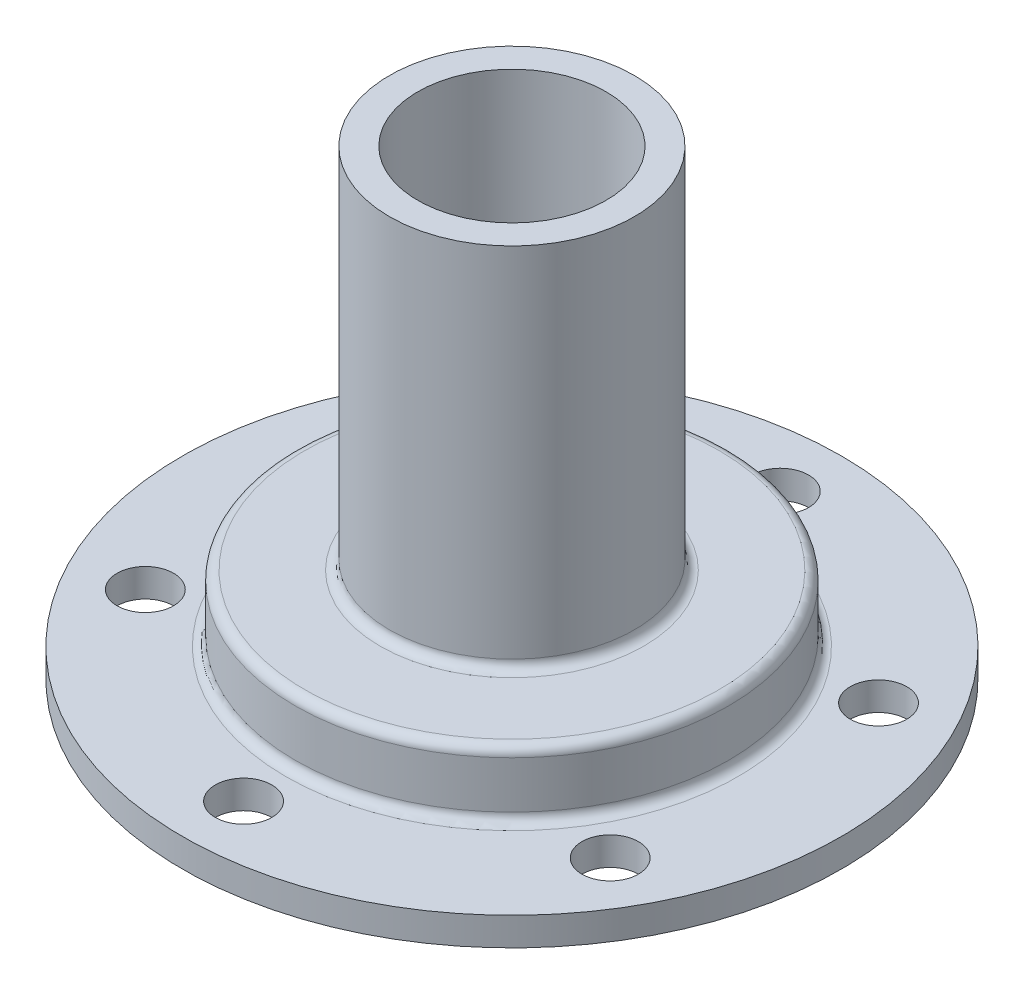
ISO-10303-21;
HEADER;
FILE_DESCRIPTION(('STEP AP214'),'2;1');
FILE_NAME('part.step','',(''),(''),'','','');
FILE_SCHEMA(('AUTOMOTIVE_DESIGN { 1 0 10303 214 1 1 1 1 }'));
ENDSEC;
DATA;
#1=APPLICATION_CONTEXT('core data for automotive mechanical design processes');
#2=APPLICATION_PROTOCOL_DEFINITION('international standard','automotive_design',2000,#1);
#3=PRODUCT_CONTEXT('',#1,'mechanical');
#4=PRODUCT('Part','Part','',(#3));
#5=PRODUCT_RELATED_PRODUCT_CATEGORY('part','',(#4));
#6=PRODUCT_DEFINITION_FORMATION('','',#4);
#7=PRODUCT_DEFINITION_CONTEXT('part definition',#1,'design');
#8=PRODUCT_DEFINITION('design','',#6,#7);
#9=PRODUCT_DEFINITION_SHAPE('','',#8);
#10=(LENGTH_UNIT() NAMED_UNIT(*) SI_UNIT(.MILLI.,.METRE.));
#11=(NAMED_UNIT(*) PLANE_ANGLE_UNIT() SI_UNIT($,.RADIAN.));
#12=(NAMED_UNIT(*) SI_UNIT($,.STERADIAN.) SOLID_ANGLE_UNIT());
#13=UNCERTAINTY_MEASURE_WITH_UNIT(LENGTH_MEASURE(1.E-05),#10,'distance_accuracy_value','');
#14=(GEOMETRIC_REPRESENTATION_CONTEXT(3) GLOBAL_UNCERTAINTY_ASSIGNED_CONTEXT((#13)) GLOBAL_UNIT_ASSIGNED_CONTEXT((#10,
#11,#12)) REPRESENTATION_CONTEXT('',''));
#15=CARTESIAN_POINT('',(0.,0.,0.));
#16=DIRECTION('',(0.,0.,1.));
#17=DIRECTION('',(1.,0.,0.));
#18=AXIS2_PLACEMENT_3D('',#15,#16,#17);
#19=CARTESIAN_POINT('',(0.,0.,0.));
#20=DIRECTION('',(0.,-1.,0.));
#21=DIRECTION('',(0.,0.,-1.));
#22=AXIS2_PLACEMENT_3D('',#19,#20,#21);
#23=CYLINDRICAL_SURFACE('',#22,20.);
#24=CARTESIAN_POINT('',(0.,0.,0.));
#25=DIRECTION('',(0.,-1.,0.));
#26=DIRECTION('',(0.,0.,-1.));
#27=AXIS2_PLACEMENT_3D('',#24,#25,#26);
#28=CIRCLE('',#27,20.);
#29=CARTESIAN_POINT('',(0.,0.,-20.));
#30=VERTEX_POINT('',#29);
#31=EDGE_CURVE('E84',#30,#30,#28,.T.);
#32=ORIENTED_EDGE('',*,*,#31,.T.);
#33=EDGE_LOOP('',(#32));
#34=FACE_BOUND('',#33,.T.);
#35=CARTESIAN_POINT('',(0.,6.,0.));
#36=DIRECTION('',(0.,-1.,0.));
#37=DIRECTION('',(0.,0.,-1.));
#38=AXIS2_PLACEMENT_3D('',#35,#36,#37);
#39=CIRCLE('',#38,20.);
#40=CARTESIAN_POINT('',(0.,6.,-20.));
#41=VERTEX_POINT('',#40);
#42=EDGE_CURVE('E10',#41,#41,#39,.T.);
#43=ORIENTED_EDGE('',*,*,#42,.F.);
#44=EDGE_LOOP('',(#43));
#45=FACE_BOUND('',#44,.T.);
#46=ADVANCED_FACE('F34',(#34,#45),#23,.F.);
#47=CARTESIAN_POINT('',(0.,6.,0.));
#48=DIRECTION('',(0.,-1.,0.));
#49=DIRECTION('',(0.,0.,-1.));
#50=AXIS2_PLACEMENT_3D('',#47,#48,#49);
#51=TOROIDAL_SURFACE('',#50,19.,0.999999999999999);
#52=ORIENTED_EDGE('',*,*,#42,.T.);
#53=EDGE_LOOP('',(#52));
#54=FACE_BOUND('',#53,.T.);
#55=CARTESIAN_POINT('',(0.,7.,0.));
#56=DIRECTION('',(0.,-1.,0.));
#57=DIRECTION('',(0.,0.,-1.));
#58=AXIS2_PLACEMENT_3D('',#55,#56,#57);
#59=CIRCLE('',#58,19.);
#60=CARTESIAN_POINT('',(0.,7.,-19.));
#61=VERTEX_POINT('',#60);
#62=EDGE_CURVE('E45',#61,#61,#59,.T.);
#63=ORIENTED_EDGE('',*,*,#62,.F.);
#64=EDGE_LOOP('',(#63));
#65=FACE_BOUND('',#64,.T.);
#66=ADVANCED_FACE('F207',(#54,#65),#51,.F.);
#67=CARTESIAN_POINT('',(10.,7.,0.));
#68=DIRECTION('',(0.,-1.,0.));
#69=DIRECTION('',(0.,0.,-1.));
#70=AXIS2_PLACEMENT_3D('',#67,#68,#69);
#71=PLANE('',#70);
#72=ORIENTED_EDGE('',*,*,#62,.T.);
#73=EDGE_LOOP('',(#72));
#74=FACE_BOUND('',#73,.T.);
#75=CARTESIAN_POINT('',(0.,7.,0.));
#76=DIRECTION('',(0.,-1.,0.));
#77=DIRECTION('',(0.,0.,-1.));
#78=AXIS2_PLACEMENT_3D('',#75,#76,#77);
#79=CIRCLE('',#78,10.);
#80=CARTESIAN_POINT('',(0.,7.,-10.));
#81=VERTEX_POINT('',#80);
#82=EDGE_CURVE('E49',#81,#81,#79,.T.);
#83=ORIENTED_EDGE('',*,*,#82,.F.);
#84=EDGE_LOOP('',(#83));
#85=FACE_BOUND('',#84,.T.);
#86=ADVANCED_FACE('F203',(#74,#85),#71,.T.);
#87=CARTESIAN_POINT('',(0.,0.,0.));
#88=DIRECTION('',(0.,-1.,0.));
#89=DIRECTION('',(0.,0.,-1.));
#90=AXIS2_PLACEMENT_3D('',#87,#88,#89);
#91=CYLINDRICAL_SURFACE('',#90,10.);
#92=CARTESIAN_POINT('',(-9.68245836551854,34.,-2.5));
#93=CARTESIAN_POINT('',(-9.6824610008786,34.1380507509266,-2.49999607859307));
#94=CARTESIAN_POINT('',(-9.68544306014597,34.2761448986785,-2.48852624549765));
#95=CARTESIAN_POINT('',(-9.69701861992564,34.5483675781735,-2.44302312546379));
#96=CARTESIAN_POINT('',(-9.7056153862163,34.6824937544682,-2.40897670674211));
#97=CARTESIAN_POINT('',(-9.72738724596151,34.9428035381872,-2.31949119963204));
#98=CARTESIAN_POINT('',(-9.74055642690458,35.0689971553857,-2.26407972785449));
#99=CARTESIAN_POINT('',(-9.76998192028759,35.3103108525399,-2.13352114126138));
#100=CARTESIAN_POINT('',(-9.78623836378489,35.4254304620802,-2.05837318856068));
#101=CARTESIAN_POINT('',(-9.82040716355625,35.6438616452622,-1.88870842731188));
#102=CARTESIAN_POINT('',(-9.83834597623034,35.74689360035,-1.79383688770405));
#103=CARTESIAN_POINT('',(-9.87362875515294,35.9357613943603,-1.58818206410066));
#104=CARTESIAN_POINT('',(-9.89097266566389,36.0215956256217,-1.4773972941803));
#105=CARTESIAN_POINT('',(-9.92340415520583,36.1747754676313,-1.24114520107895));
#106=CARTESIAN_POINT('',(-9.93845687400593,36.2418463881615,-1.11549457619512));
#107=CARTESIAN_POINT('',(-9.96430811925984,36.3538096441531,-0.854263184292761));
#108=CARTESIAN_POINT('',(-9.97510727334345,36.3987052519155,-0.718683885791939));
#109=CARTESIAN_POINT('',(-9.9910475884818,36.4641478345786,-0.44435875875416));
#110=CARTESIAN_POINT('',(-9.99629893844314,36.4851696443266,-0.305732719548974));
#111=CARTESIAN_POINT('',(-10.000935941073,36.5037583792756,-0.0268288192627668));
#112=CARTESIAN_POINT('',(-10.000322460967,36.5013287722096,0.113448794538072));
#113=CARTESIAN_POINT('',(-9.99338094953534,36.4734251497499,0.388380617930973));
#114=CARTESIAN_POINT('',(-9.98718002340871,36.4484636749461,0.523090539002673));
#115=CARTESIAN_POINT('',(-9.96990836524857,36.3770287299515,0.786345618534221));
#116=CARTESIAN_POINT('',(-9.95883737398452,36.3305541146226,0.914890448426099));
#117=CARTESIAN_POINT('',(-9.93287509700884,36.2169974293129,1.16351675875452));
#118=CARTESIAN_POINT('',(-9.91795019695011,36.1497329553383,1.28351127441627));
#119=CARTESIAN_POINT('',(-9.88589903809692,35.9966443208837,1.51068905585123));
#120=CARTESIAN_POINT('',(-9.8687723965265,35.9108169314394,1.61787008771377));
#121=CARTESIAN_POINT('',(-9.83363713769356,35.7202912580176,1.81943508771239));
#122=CARTESIAN_POINT('',(-9.81561719525297,35.6151451076522,1.913394197688));
#123=CARTESIAN_POINT('',(-9.78115043517327,35.3904000264597,2.08244093990756));
#124=CARTESIAN_POINT('',(-9.76470369108288,35.2708004205089,2.15752769011507));
#125=CARTESIAN_POINT('',(-9.73520496829319,35.0197099658511,2.28697032255647));
#126=CARTESIAN_POINT('',(-9.72216983717007,34.8881642696872,2.34122391742613));
#127=CARTESIAN_POINT('',(-9.70118640148669,34.6174145319231,2.42671405159096));
#128=CARTESIAN_POINT('',(-9.69323700842733,34.4782121360154,2.45795551638266));
#129=CARTESIAN_POINT('',(-9.68355356007457,34.2000404984701,2.49582963866592));
#130=CARTESIAN_POINT('',(-9.68166088976934,34.061162206659,2.50309047391912));
#131=CARTESIAN_POINT('',(-9.68387343364692,33.7841780634147,2.49451699051516));
#132=CARTESIAN_POINT('',(-9.687978095703,33.6460721420505,2.47868479784981));
#133=CARTESIAN_POINT('',(-9.7015708198498,33.3768857350514,2.42492546393825));
#134=CARTESIAN_POINT('',(-9.71096970242532,33.2457272734308,2.38736406828191));
#135=CARTESIAN_POINT('',(-9.73400718262805,32.9915685421467,2.29161808167046));
#136=CARTESIAN_POINT('',(-9.74764628246408,32.8685692409442,2.2334310477125));
#137=CARTESIAN_POINT('',(-9.77796137095512,32.6315587221331,2.0967706679366));
#138=CARTESIAN_POINT('',(-9.79469168607245,32.517771159957,2.01792175383564));
#139=CARTESIAN_POINT('',(-9.82917083071113,32.3048116371985,1.84265073233613));
#140=CARTESIAN_POINT('',(-9.84691982728307,32.2056420833499,1.74622573701359));
#141=CARTESIAN_POINT('',(-9.88197403031774,32.0221889574291,1.53565680246182));
#142=CARTESIAN_POINT('',(-9.8992570206188,31.9383399374512,1.42112988132898));
#143=CARTESIAN_POINT('',(-9.9309721661369,31.7910641330487,1.17925670673668));
#144=CARTESIAN_POINT('',(-9.9454044700395,31.7276362833918,1.05191112239398));
#145=CARTESIAN_POINT('',(-9.96970115738325,31.6235539654721,0.788895504327725));
#146=CARTESIAN_POINT('',(-9.9795983002241,31.5827357156209,0.653293452569702));
#147=CARTESIAN_POINT('',(-9.99385293395789,31.5245396653916,0.376874400797013));
#148=CARTESIAN_POINT('',(-9.99821149393422,31.507157341261,0.236058412603098));
#149=CARTESIAN_POINT('',(-10.0008542352202,31.4965810260612,-0.0427088161083107));
#150=CARTESIAN_POINT('',(-9.99929947199971,31.5027457272615,-0.180634567415057));
#151=CARTESIAN_POINT('',(-9.99064741143608,31.5376195682359,-0.45341874103688));
#152=CARTESIAN_POINT('',(-9.98355027892923,31.5663280375329,-0.588277254452324));
#153=CARTESIAN_POINT('',(-9.96463582134723,31.6451305494271,-0.850427589111938));
#154=CARTESIAN_POINT('',(-9.95284411255981,31.6951086332859,-0.977756236452161));
#155=CARTESIAN_POINT('',(-9.92578222284145,31.8149264475489,-1.22229263260406));
#156=CARTESIAN_POINT('',(-9.91051160346894,31.8847686816762,-1.33949910316409));
#157=CARTESIAN_POINT('',(-9.87768124200718,32.0442880849903,-1.56350482105826));
#158=CARTESIAN_POINT('',(-9.86007542354162,32.1344003572596,-1.66998747074584));
#159=CARTESIAN_POINT('',(-9.82476622642974,32.3310571299434,-1.86653755068376));
#160=CARTESIAN_POINT('',(-9.80706282418256,32.4376057902779,-1.95660081269148));
#161=CARTESIAN_POINT('',(-9.77318689613756,32.6665035354737,-2.11940506617959));
#162=CARTESIAN_POINT('',(-9.75704909183222,32.7891103084131,-2.19179154854095));
#163=CARTESIAN_POINT('',(-9.7285988873707,33.0451387246871,-2.31481724146368));
#164=CARTESIAN_POINT('',(-9.71628370583035,33.1785524152346,-2.36547227438038));
#165=CARTESIAN_POINT('',(-9.69879771876843,33.4264425295879,-2.43605632142751));
#166=CARTESIAN_POINT('',(-9.69271657508747,33.5397329109653,-2.4599829264922));
#167=CARTESIAN_POINT('',(-9.6845459645655,33.7686721724942,-2.49195573142943));
#168=CARTESIAN_POINT('',(-9.6824561572277,33.884320850611,-2.50000328592938));
#169=CARTESIAN_POINT('',(-9.68245836551854,34.,-2.5));
#170=B_SPLINE_CURVE_WITH_KNOTS('',3,(#92,#93,#94,#95,#96,#97,#98,#99,#100,#101,#102,#103,#104,
#105,#106,#107,#108,#109,#110,#111,#112,#113,#114,#115,#116,#117,#118,#119,#120,#121,#122,#123,
#124,#125,#126,#127,#128,#129,#130,#131,#132,#133,#134,#135,#136,#137,#138,#139,#140,#141,#142,
#143,#144,#145,#146,#147,#148,#149,#150,#151,#152,#153,#154,#155,#156,#157,#158,#159,#160,#161,
#162,#163,#164,#165,#166,#167,#168,#169),.UNSPECIFIED.,.T.,.F.,(4,2,2,2,2,2,2,2,2,2,2,2,2,2,2,2,
2,2,2,2,2,2,2,2,2,2,2,2,2,2,2,2,2,2,2,2,2,2,4),(0.,0.413727441736142,0.82769574142867,
1.24113072716602,1.65458326755479,2.07623954192977,2.49793521479867,2.9255149639792,
3.35303159847093,3.77188750995347,4.19068148666021,4.60018262688948,5.00970556724787,
5.42292874254446,5.83622385468915,6.26070466571913,6.68520531199803,7.11176432008404,
7.53823200129548,7.95343574764205,8.36860127188748,8.77697405014153,9.18539521426364,
9.60182845864103,10.0183301888999,10.4452533097027,10.872154157245,11.2959207281188,
11.7196054891398,12.131834461324,12.5440511738193,12.9540487656466,13.3640980574302,
13.7839709658702,14.2039503157046,14.6317647729114,15.0592672137502,15.4059782718573,
15.7526597510792),.UNSPECIFIED.);
#171=CARTESIAN_POINT('',(-9.68245836551854,34.,-2.5));
#172=VERTEX_POINT('',#171);
#173=EDGE_CURVE('E121',#172,#172,#170,.T.);
#174=ORIENTED_EDGE('',*,*,#173,.F.);
#175=EDGE_LOOP('',(#174));
#176=FACE_BOUND('',#175,.T.);
#177=ORIENTED_EDGE('',*,*,#82,.T.);
#178=EDGE_LOOP('',(#177));
#179=FACE_BOUND('',#178,.T.);
#180=CARTESIAN_POINT('',(0.,49.,0.));
#181=DIRECTION('',(0.,-1.,0.));
#182=DIRECTION('',(0.,0.,-1.));
#183=AXIS2_PLACEMENT_3D('',#180,#181,#182);
#184=CIRCLE('',#183,10.);
#185=CARTESIAN_POINT('',(0.,49.,-10.));
#186=VERTEX_POINT('',#185);
#187=EDGE_CURVE('E54',#186,#186,#184,.T.);
#188=ORIENTED_EDGE('',*,*,#187,.F.);
#189=EDGE_LOOP('',(#188));
#190=FACE_BOUND('',#189,.T.);
#191=ADVANCED_FACE('F128',(#176,#179,#190),#91,.F.);
#192=CARTESIAN_POINT('',(13.,49.,0.));
#193=DIRECTION('',(0.,1.,0.));
#194=DIRECTION('',(0.,0.,1.));
#195=AXIS2_PLACEMENT_3D('',#192,#193,#194);
#196=PLANE('',#195);
#197=ORIENTED_EDGE('',*,*,#187,.T.);
#198=EDGE_LOOP('',(#197));
#199=FACE_BOUND('',#198,.T.);
#200=CARTESIAN_POINT('',(0.,49.,0.));
#201=DIRECTION('',(0.,-1.,0.));
#202=DIRECTION('',(0.,0.,-1.));
#203=AXIS2_PLACEMENT_3D('',#200,#201,#202);
#204=CIRCLE('',#203,13.);
#205=CARTESIAN_POINT('',(0.,49.,-13.));
#206=VERTEX_POINT('',#205);
#207=EDGE_CURVE('E57',#206,#206,#204,.T.);
#208=ORIENTED_EDGE('',*,*,#207,.F.);
#209=EDGE_LOOP('',(#208));
#210=FACE_BOUND('',#209,.T.);
#211=ADVANCED_FACE('F196',(#199,#210),#196,.T.);
#212=CARTESIAN_POINT('',(0.,0.,0.));
#213=DIRECTION('',(0.,-1.,0.));
#214=DIRECTION('',(0.,0.,-1.));
#215=AXIS2_PLACEMENT_3D('',#212,#213,#214);
#216=CYLINDRICAL_SURFACE('',#215,13.);
#217=CARTESIAN_POINT('',(-12.7573508221731,34.,-2.5));
#218=CARTESIAN_POINT('',(-12.7573535445971,33.8609741402386,-2.49999473771111));
#219=CARTESIAN_POINT('',(-12.759648106677,33.7218807698169,-2.48836372459743));
#220=CARTESIAN_POINT('',(-12.7685662321878,33.4476209411147,-2.44218113719487));
#221=CARTESIAN_POINT('',(-12.7751933891363,33.3124578399415,-2.40761053611891));
#222=CARTESIAN_POINT('',(-12.7919990068767,33.0500663552577,-2.31665374663639));
#223=CARTESIAN_POINT('',(-12.8021740742201,32.9228305261755,-2.26028839852833));
#224=CARTESIAN_POINT('',(-12.8249250156472,32.6796274500609,-2.12739803553043));
#225=CARTESIAN_POINT('',(-12.8375007225812,32.5636594193318,-2.05087442406184));
#226=CARTESIAN_POINT('',(-12.8638197867113,32.3447587875637,-1.8787724582243));
#227=CARTESIAN_POINT('',(-12.8775751102276,32.2419950504917,-1.78298111863696));
#228=CARTESIAN_POINT('',(-12.9045979802699,32.0538924698524,-1.5755231225806));
#229=CARTESIAN_POINT('',(-12.9178654939172,31.9685547990555,-1.46385539849172));
#230=CARTESIAN_POINT('',(-12.9425463769484,31.8170765897423,-1.22670187107625));
#231=CARTESIAN_POINT('',(-12.9539439985905,31.751095741295,-1.10111228887017));
#232=CARTESIAN_POINT('',(-12.9734667695503,31.6412335746728,-0.840374478610752));
#233=CARTESIAN_POINT('',(-12.9815922019259,31.5973503448801,-0.705227078537796));
#234=CARTESIAN_POINT('',(-12.9935705508999,31.5334525964944,-0.43096084517345));
#235=CARTESIAN_POINT('',(-12.9974744160998,31.5131532248799,-0.291910638125103));
#236=CARTESIAN_POINT('',(-13.0007455117712,31.4961114167779,-0.0123270709409613));
#237=CARTESIAN_POINT('',(-13.000113147748,31.499366874664,0.128206155502511));
#238=CARTESIAN_POINT('',(-12.9944227232997,31.5291247626059,0.404811580289862));
#239=CARTESIAN_POINT('',(-12.9894230651197,31.5553204331309,0.540918156089662));
#240=CARTESIAN_POINT('',(-12.9756254537905,31.6297294543125,0.806767049653702));
#241=CARTESIAN_POINT('',(-12.9668273569848,31.6779436377117,0.936509126506348));
#242=CARTESIAN_POINT('',(-12.9463243258099,31.7953102821441,1.18683036724386));
#243=CARTESIAN_POINT('',(-12.9346025687447,31.864584445285,1.30735103519341));
#244=CARTESIAN_POINT('',(-12.9095469786328,32.0220147939395,1.53517146817959));
#245=CARTESIAN_POINT('',(-12.8962129735448,32.1101729953257,1.64246981980512));
#246=CARTESIAN_POINT('',(-12.8691545349335,32.3045565091686,1.84261846944045));
#247=CARTESIAN_POINT('',(-12.855427272809,32.411050234235,1.93520788986346));
#248=CARTESIAN_POINT('',(-12.8293343997587,32.6381901746724,2.10125316353159));
#249=CARTESIAN_POINT('',(-12.8169688108631,32.7588366189528,2.17470870723888));
#250=CARTESIAN_POINT('',(-12.7949946866483,33.0112140172712,2.30048133251874));
#251=CARTESIAN_POINT('',(-12.785391318016,33.1429651551236,2.35275887460558));
#252=CARTESIAN_POINT('',(-12.7701067672006,33.4136075543789,2.43436110074129));
#253=CARTESIAN_POINT('',(-12.7644251156011,33.5524979590964,2.4636885318979));
#254=CARTESIAN_POINT('',(-12.7577206137951,33.8311193246285,2.49817375220936));
#255=CARTESIAN_POINT('',(-12.7566253860666,33.9708021136838,2.50370706985663));
#256=CARTESIAN_POINT('',(-12.7590238308419,34.2490953638697,2.49145509963842));
#257=CARTESIAN_POINT('',(-12.7625172639236,34.3877058805686,2.4736710284025));
#258=CARTESIAN_POINT('',(-12.7736318530023,34.6586749431925,2.41561200598846));
#259=CARTESIAN_POINT('',(-12.7812165991315,34.7910776041666,2.37553534674614));
#260=CARTESIAN_POINT('',(-12.7996276252393,35.0472888474545,2.27423978654129));
#261=CARTESIAN_POINT('',(-12.8104541548475,35.1710967670358,2.21301925736502));
#262=CARTESIAN_POINT('',(-12.8342928537119,35.408254242385,2.07031485911768));
#263=CARTESIAN_POINT('',(-12.8473298999345,35.5214590144377,1.98859461228271));
#264=CARTESIAN_POINT('',(-12.8740513624295,35.732685118866,1.80752787788233));
#265=CARTESIAN_POINT('',(-12.8877358399847,35.8307050101472,1.70817971928818));
#266=CARTESIAN_POINT('',(-12.9144437282901,36.0101897520335,1.49299681253014));
#267=CARTESIAN_POINT('',(-12.9274550888692,36.0914015320574,1.37694924353664));
#268=CARTESIAN_POINT('',(-12.951145430407,36.2331753060949,1.13263940226607));
#269=CARTESIAN_POINT('',(-12.9618245043496,36.2937381233966,1.00437761723896));
#270=CARTESIAN_POINT('',(-12.9795953468859,36.3921197298356,0.739966613700503));
#271=CARTESIAN_POINT('',(-12.9867063704086,36.4300608106462,0.603864248412592));
#272=CARTESIAN_POINT('',(-12.9966222021743,36.4825111946202,0.327068775042131));
#273=CARTESIAN_POINT('',(-12.9994274881639,36.4970230973968,0.186376178041923));
#274=CARTESIAN_POINT('',(-13.0004055871504,36.5021088314925,-0.0931827521181711));
#275=CARTESIAN_POINT('',(-12.9986522399737,36.4930642223302,-0.23204202862034));
#276=CARTESIAN_POINT('',(-12.9908642019523,36.4521319198343,-0.506222907249131));
#277=CARTESIAN_POINT('',(-12.9848295568325,36.4202444704656,-0.641544547142222));
#278=CARTESIAN_POINT('',(-12.9691577474469,36.3346958076119,-0.904593549254302));
#279=CARTESIAN_POINT('',(-12.9595276339264,36.2810771916485,-1.03233521137864));
#280=CARTESIAN_POINT('',(-12.9377052532993,36.1536348854929,-1.27706488245869));
#281=CARTESIAN_POINT('',(-12.9255128027328,36.0798097484262,-1.39405212054941));
#282=CARTESIAN_POINT('',(-12.8996784805017,35.9127465496702,-1.61584795767645));
#283=CARTESIAN_POINT('',(-12.8860176059801,35.8192338279224,-1.72044748489625));
#284=CARTESIAN_POINT('',(-12.8589033276349,35.6160178174388,-1.91260166612258));
#285=CARTESIAN_POINT('',(-12.8454499734772,35.5063107173201,-2.00015229635294));
#286=CARTESIAN_POINT('',(-12.8201292259648,35.2725301610452,-2.15653452422156));
#287=CARTESIAN_POINT('',(-12.8082786988589,35.148326241084,-2.22517391596927));
#288=CARTESIAN_POINT('',(-12.7877094152025,34.8899592262486,-2.340501544276));
#289=CARTESIAN_POINT('',(-12.7789877475578,34.7558055296597,-2.3872101977801));
#290=CARTESIAN_POINT('',(-12.7674530961672,34.5177416252547,-2.4480213622143));
#291=CARTESIAN_POINT('',(-12.7636876084207,34.4152120123956,-2.46747939479383));
#292=CARTESIAN_POINT('',(-12.7586354876446,34.2084675536626,-2.49347049397996));
#293=CARTESIAN_POINT('',(-12.7573487806808,34.1042527581459,-2.50000394608695));
#294=CARTESIAN_POINT('',(-12.7573508221731,34.,-2.5));
#295=B_SPLINE_CURVE_WITH_KNOTS('',3,(#217,#218,#219,#220,#221,#222,#223,#224,#225,#226,#227,
#228,#229,#230,#231,#232,#233,#234,#235,#236,#237,#238,#239,#240,#241,#242,#243,#244,#245,#246,
#247,#248,#249,#250,#251,#252,#253,#254,#255,#256,#257,#258,#259,#260,#261,#262,#263,#264,#265,
#266,#267,#268,#269,#270,#271,#272,#273,#274,#275,#276,#277,#278,#279,#280,#281,#282,#283,#284,
#285,#286,#287,#288,#289,#290,#291,#292,#293,#294),.UNSPECIFIED.,.T.,.F.,(4,2,2,2,2,2,2,2,2,2,2,
2,2,2,2,2,2,2,2,2,2,2,2,2,2,2,2,2,2,2,2,2,2,2,2,2,2,2,4),(0.,0.416695988880001,0.83373803073764,
1.25038227614466,1.66699752238094,2.08849971831381,2.5100302719089,2.93494642182602,
3.35982580683554,3.77951819081206,4.19917305788035,4.61330049028081,5.02744358632398,
5.44402696725573,5.86065484067581,6.28400091938149,6.70735384633276,7.13149357344849,
7.55558252364952,7.97295317898355,8.39030205806815,8.80399666093121,9.21772312804068,
9.63645909210583,10.0552347712562,10.4799185943275,10.9045854829869,11.32693532976,
11.7492383109661,12.1647436860036,12.5802446234503,12.9949350033565,13.4096550846627,
13.8305978202814,14.251639784134,14.6768151908599,15.1015939816585,15.4140754294552,
15.7265475567532),.UNSPECIFIED.);
#296=CARTESIAN_POINT('',(-12.7573508221731,34.,-2.5));
#297=VERTEX_POINT('',#296);
#298=EDGE_CURVE('E37',#297,#297,#295,.T.);
#299=ORIENTED_EDGE('',*,*,#298,.F.);
#300=EDGE_LOOP('',(#299));
#301=FACE_BOUND('',#300,.T.);
#302=ORIENTED_EDGE('',*,*,#207,.T.);
#303=EDGE_LOOP('',(#302));
#304=FACE_BOUND('',#303,.T.);
#305=CARTESIAN_POINT('',(0.,11.,0.));
#306=DIRECTION('',(0.,-1.,0.));
#307=DIRECTION('',(0.,0.,-1.));
#308=AXIS2_PLACEMENT_3D('',#305,#306,#307);
#309=CIRCLE('',#308,13.);
#310=CARTESIAN_POINT('',(0.,11.,-13.));
#311=VERTEX_POINT('',#310);
#312=EDGE_CURVE('E60',#311,#311,#309,.T.);
#313=ORIENTED_EDGE('',*,*,#312,.F.);
#314=EDGE_LOOP('',(#313));
#315=FACE_BOUND('',#314,.T.);
#316=ADVANCED_FACE('F192',(#301,#304,#315),#216,.T.);
#317=CARTESIAN_POINT('',(0.,11.,0.));
#318=DIRECTION('',(0.,-1.,0.));
#319=DIRECTION('',(0.,0.,-1.));
#320=AXIS2_PLACEMENT_3D('',#317,#318,#319);
#321=TOROIDAL_SURFACE('',#320,14.,1.);
#322=ORIENTED_EDGE('',*,*,#312,.T.);
#323=EDGE_LOOP('',(#322));
#324=FACE_BOUND('',#323,.T.);
#325=CARTESIAN_POINT('',(0.,10.,0.));
#326=DIRECTION('',(0.,-1.,0.));
#327=DIRECTION('',(0.,0.,-1.));
#328=AXIS2_PLACEMENT_3D('',#325,#326,#327);
#329=CIRCLE('',#328,14.);
#330=CARTESIAN_POINT('',(0.,10.,-14.));
#331=VERTEX_POINT('',#330);
#332=EDGE_CURVE('E63',#331,#331,#329,.T.);
#333=ORIENTED_EDGE('',*,*,#332,.F.);
#334=EDGE_LOOP('',(#333));
#335=FACE_BOUND('',#334,.T.);
#336=ADVANCED_FACE('F189',(#324,#335),#321,.F.);
#337=CARTESIAN_POINT('',(22.,10.,0.));
#338=DIRECTION('',(0.,1.,0.));
#339=DIRECTION('',(0.,0.,1.));
#340=AXIS2_PLACEMENT_3D('',#337,#338,#339);
#341=PLANE('',#340);
#342=ORIENTED_EDGE('',*,*,#332,.T.);
#343=EDGE_LOOP('',(#342));
#344=FACE_BOUND('',#343,.T.);
#345=CARTESIAN_POINT('',(0.,10.,0.));
#346=DIRECTION('',(0.,-1.,0.));
#347=DIRECTION('',(0.,0.,-1.));
#348=AXIS2_PLACEMENT_3D('',#345,#346,#347);
#349=CIRCLE('',#348,22.);
#350=CARTESIAN_POINT('',(0.,10.,-22.));
#351=VERTEX_POINT('',#350);
#352=EDGE_CURVE('E66',#351,#351,#349,.T.);
#353=ORIENTED_EDGE('',*,*,#352,.F.);
#354=EDGE_LOOP('',(#353));
#355=FACE_BOUND('',#354,.T.);
#356=ADVANCED_FACE('F185',(#344,#355),#341,.T.);
#357=CARTESIAN_POINT('',(0.,9.,0.));
#358=DIRECTION('',(0.,-1.,0.));
#359=DIRECTION('',(0.,0.,-1.));
#360=AXIS2_PLACEMENT_3D('',#357,#358,#359);
#361=TOROIDAL_SURFACE('',#360,22.,1.);
#362=ORIENTED_EDGE('',*,*,#352,.T.);
#363=EDGE_LOOP('',(#362));
#364=FACE_BOUND('',#363,.T.);
#365=CARTESIAN_POINT('',(0.,9.,0.));
#366=DIRECTION('',(0.,-1.,0.));
#367=DIRECTION('',(0.,0.,-1.));
#368=AXIS2_PLACEMENT_3D('',#365,#366,#367);
#369=CIRCLE('',#368,23.);
#370=CARTESIAN_POINT('',(0.,9.,-23.));
#371=VERTEX_POINT('',#370);
#372=EDGE_CURVE('E69',#371,#371,#369,.T.);
#373=ORIENTED_EDGE('',*,*,#372,.F.);
#374=EDGE_LOOP('',(#373));
#375=FACE_BOUND('',#374,.T.);
#376=ADVANCED_FACE('F181',(#364,#375),#361,.T.);
#377=CARTESIAN_POINT('',(0.,0.,0.));
#378=DIRECTION('',(0.,-1.,0.));
#379=DIRECTION('',(0.,0.,-1.));
#380=AXIS2_PLACEMENT_3D('',#377,#378,#379);
#381=CYLINDRICAL_SURFACE('',#380,23.);
#382=ORIENTED_EDGE('',*,*,#372,.T.);
#383=EDGE_LOOP('',(#382));
#384=FACE_BOUND('',#383,.T.);
#385=CARTESIAN_POINT('',(0.,4.,0.));
#386=DIRECTION('',(0.,-1.,0.));
#387=DIRECTION('',(0.,0.,-1.));
#388=AXIS2_PLACEMENT_3D('',#385,#386,#387);
#389=CIRCLE('',#388,23.);
#390=CARTESIAN_POINT('',(0.,4.,-23.));
#391=VERTEX_POINT('',#390);
#392=EDGE_CURVE('E72',#391,#391,#389,.T.);
#393=ORIENTED_EDGE('',*,*,#392,.F.);
#394=EDGE_LOOP('',(#393));
#395=FACE_BOUND('',#394,.T.);
#396=ADVANCED_FACE('F177',(#384,#395),#381,.T.);
#397=CARTESIAN_POINT('',(0.,4.,0.));
#398=DIRECTION('',(0.,-1.,0.));
#399=DIRECTION('',(0.,0.,-1.));
#400=AXIS2_PLACEMENT_3D('',#397,#398,#399);
#401=TOROIDAL_SURFACE('',#400,24.,1.);
#402=ORIENTED_EDGE('',*,*,#392,.T.);
#403=EDGE_LOOP('',(#402));
#404=FACE_BOUND('',#403,.T.);
#405=CARTESIAN_POINT('',(0.,3.,0.));
#406=DIRECTION('',(0.,-1.,0.));
#407=DIRECTION('',(0.,0.,-1.));
#408=AXIS2_PLACEMENT_3D('',#405,#406,#407);
#409=CIRCLE('',#408,24.);
#410=CARTESIAN_POINT('',(0.,3.,-24.));
#411=VERTEX_POINT('',#410);
#412=EDGE_CURVE('E75',#411,#411,#409,.T.);
#413=ORIENTED_EDGE('',*,*,#412,.F.);
#414=EDGE_LOOP('',(#413));
#415=FACE_BOUND('',#414,.T.);
#416=ADVANCED_FACE('F173',(#404,#415),#401,.F.);
#417=CARTESIAN_POINT('',(35.,3.,0.));
#418=DIRECTION('',(0.,1.,0.));
#419=DIRECTION('',(0.,0.,1.));
#420=AXIS2_PLACEMENT_3D('',#417,#418,#419);
#421=PLANE('',#420);
#422=CARTESIAN_POINT('',(-24.6817240078553,3.,-14.249999999998));
#423=DIRECTION('',(0.,1.,0.));
#424=DIRECTION('',(0.,0.,1.));
#425=AXIS2_PLACEMENT_3D('',#422,#423,#424);
#426=CIRCLE('',#425,3.);
#427=CARTESIAN_POINT('',(-24.6817240078553,3.,-11.249999999998));
#428=VERTEX_POINT('',#427);
#429=EDGE_CURVE('E118',#428,#428,#426,.T.);
#430=ORIENTED_EDGE('',*,*,#429,.F.);
#431=EDGE_LOOP('',(#430));
#432=FACE_BOUND('',#431,.T.);
#433=CARTESIAN_POINT('',(-24.681724007853,3.,14.250000000002));
#434=DIRECTION('',(0.,1.,0.));
#435=DIRECTION('',(0.,0.,1.));
#436=AXIS2_PLACEMENT_3D('',#433,#434,#435);
#437=CIRCLE('',#436,3.);
#438=CARTESIAN_POINT('',(-24.681724007853,3.,17.250000000002));
#439=VERTEX_POINT('',#438);
#440=EDGE_CURVE('E112',#439,#439,#437,.T.);
#441=ORIENTED_EDGE('',*,*,#440,.F.);
#442=EDGE_LOOP('',(#441));
#443=FACE_BOUND('',#442,.T.);
#444=CARTESIAN_POINT('',(4.6728656272083E-12,3.,28.5));
#445=DIRECTION('',(0.,1.,0.));
#446=DIRECTION('',(0.,0.,1.));
#447=AXIS2_PLACEMENT_3D('',#444,#445,#446);
#448=CIRCLE('',#447,3.);
#449=CARTESIAN_POINT('',(4.6728656272083E-12,3.,31.5));
#450=VERTEX_POINT('',#449);
#451=EDGE_CURVE('E106',#450,#450,#448,.T.);
#452=ORIENTED_EDGE('',*,*,#451,.F.);
#453=EDGE_LOOP('',(#452));
#454=FACE_BOUND('',#453,.T.);
#455=CARTESIAN_POINT('',(24.68172400786,3.,14.249999999998));
#456=DIRECTION('',(0.,1.,0.));
#457=DIRECTION('',(0.,0.,1.));
#458=AXIS2_PLACEMENT_3D('',#455,#456,#457);
#459=CIRCLE('',#458,3.);
#460=CARTESIAN_POINT('',(24.68172400786,3.,17.249999999998));
#461=VERTEX_POINT('',#460);
#462=EDGE_CURVE('E100',#461,#461,#459,.T.);
#463=ORIENTED_EDGE('',*,*,#462,.F.);
#464=EDGE_LOOP('',(#463));
#465=FACE_BOUND('',#464,.T.);
#466=CARTESIAN_POINT('',(24.6817240078577,3.,-14.250000000002));
#467=DIRECTION('',(0.,1.,0.));
#468=DIRECTION('',(0.,0.,1.));
#469=AXIS2_PLACEMENT_3D('',#466,#467,#468);
#470=CIRCLE('',#469,2.99999999999999);
#471=CARTESIAN_POINT('',(24.6817240078577,3.,-11.250000000002));
#472=VERTEX_POINT('',#471);
#473=EDGE_CURVE('E94',#472,#472,#470,.T.);
#474=ORIENTED_EDGE('',*,*,#473,.F.);
#475=EDGE_LOOP('',(#474));
#476=FACE_BOUND('',#475,.T.);
#477=CARTESIAN_POINT('',(0.,3.,-28.5));
#478=DIRECTION('',(0.,1.,0.));
#479=DIRECTION('',(0.,0.,1.));
#480=AXIS2_PLACEMENT_3D('',#477,#478,#479);
#481=CIRCLE('',#480,3.);
#482=CARTESIAN_POINT('',(0.,3.,-25.5));
#483=VERTEX_POINT('',#482);
#484=EDGE_CURVE('E88',#483,#483,#481,.T.);
#485=ORIENTED_EDGE('',*,*,#484,.F.);
#486=EDGE_LOOP('',(#485));
#487=FACE_BOUND('',#486,.T.);
#488=ORIENTED_EDGE('',*,*,#412,.T.);
#489=EDGE_LOOP('',(#488));
#490=FACE_BOUND('',#489,.T.);
#491=CARTESIAN_POINT('',(0.,3.,0.));
#492=DIRECTION('',(0.,-1.,0.));
#493=DIRECTION('',(0.,0.,-1.));
#494=AXIS2_PLACEMENT_3D('',#491,#492,#493);
#495=CIRCLE('',#494,35.);
#496=CARTESIAN_POINT('',(0.,3.,-35.));
#497=VERTEX_POINT('',#496);
#498=EDGE_CURVE('E78',#497,#497,#495,.T.);
#499=ORIENTED_EDGE('',*,*,#498,.F.);
#500=EDGE_LOOP('',(#499));
#501=FACE_BOUND('',#500,.T.);
#502=ADVANCED_FACE('F169',(#432,#443,#454,#465,#476,#487,#490,#501),#421,.T.);
#503=CARTESIAN_POINT('',(0.,0.,0.));
#504=DIRECTION('',(0.,-1.,0.));
#505=DIRECTION('',(0.,0.,-1.));
#506=AXIS2_PLACEMENT_3D('',#503,#504,#505);
#507=CYLINDRICAL_SURFACE('',#506,35.);
#508=ORIENTED_EDGE('',*,*,#498,.T.);
#509=EDGE_LOOP('',(#508));
#510=FACE_BOUND('',#509,.T.);
#511=CARTESIAN_POINT('',(0.,0.,0.));
#512=DIRECTION('',(0.,-1.,0.));
#513=DIRECTION('',(0.,0.,-1.));
#514=AXIS2_PLACEMENT_3D('',#511,#512,#513);
#515=CIRCLE('',#514,35.);
#516=CARTESIAN_POINT('',(0.,0.,-35.));
#517=VERTEX_POINT('',#516);
#518=EDGE_CURVE('E81',#517,#517,#515,.T.);
#519=ORIENTED_EDGE('',*,*,#518,.F.);
#520=EDGE_LOOP('',(#519));
#521=FACE_BOUND('',#520,.T.);
#522=ADVANCED_FACE('F165',(#510,#521),#507,.T.);
#523=CARTESIAN_POINT('',(20.,0.,0.));
#524=DIRECTION('',(0.,-1.,0.));
#525=DIRECTION('',(0.,0.,-1.));
#526=AXIS2_PLACEMENT_3D('',#523,#524,#525);
#527=PLANE('',#526);
#528=CARTESIAN_POINT('',(-24.6817240078553,0.,-14.249999999998));
#529=DIRECTION('',(0.,1.,0.));
#530=DIRECTION('',(0.,0.,1.));
#531=AXIS2_PLACEMENT_3D('',#528,#529,#530);
#532=CIRCLE('',#531,3.);
#533=CARTESIAN_POINT('',(-24.6817240078553,0.,-11.249999999998));
#534=VERTEX_POINT('',#533);
#535=EDGE_CURVE('E115',#534,#534,#532,.T.);
#536=ORIENTED_EDGE('',*,*,#535,.T.);
#537=EDGE_LOOP('',(#536));
#538=FACE_BOUND('',#537,.T.);
#539=CARTESIAN_POINT('',(-24.681724007853,0.,14.250000000002));
#540=DIRECTION('',(0.,1.,0.));
#541=DIRECTION('',(0.,0.,1.));
#542=AXIS2_PLACEMENT_3D('',#539,#540,#541);
#543=CIRCLE('',#542,3.);
#544=CARTESIAN_POINT('',(-24.681724007853,0.,17.250000000002));
#545=VERTEX_POINT('',#544);
#546=EDGE_CURVE('E109',#545,#545,#543,.T.);
#547=ORIENTED_EDGE('',*,*,#546,.T.);
#548=EDGE_LOOP('',(#547));
#549=FACE_BOUND('',#548,.T.);
#550=CARTESIAN_POINT('',(4.6728656272083E-12,0.,28.5));
#551=DIRECTION('',(0.,1.,0.));
#552=DIRECTION('',(0.,0.,1.));
#553=AXIS2_PLACEMENT_3D('',#550,#551,#552);
#554=CIRCLE('',#553,3.);
#555=CARTESIAN_POINT('',(4.6728656272083E-12,0.,31.5));
#556=VERTEX_POINT('',#555);
#557=EDGE_CURVE('E103',#556,#556,#554,.T.);
#558=ORIENTED_EDGE('',*,*,#557,.T.);
#559=EDGE_LOOP('',(#558));
#560=FACE_BOUND('',#559,.T.);
#561=CARTESIAN_POINT('',(24.68172400786,0.,14.249999999998));
#562=DIRECTION('',(0.,1.,0.));
#563=DIRECTION('',(0.,0.,1.));
#564=AXIS2_PLACEMENT_3D('',#561,#562,#563);
#565=CIRCLE('',#564,3.);
#566=CARTESIAN_POINT('',(24.68172400786,0.,17.249999999998));
#567=VERTEX_POINT('',#566);
#568=EDGE_CURVE('E97',#567,#567,#565,.T.);
#569=ORIENTED_EDGE('',*,*,#568,.T.);
#570=EDGE_LOOP('',(#569));
#571=FACE_BOUND('',#570,.T.);
#572=CARTESIAN_POINT('',(24.6817240078577,0.,-14.250000000002));
#573=DIRECTION('',(0.,1.,0.));
#574=DIRECTION('',(0.,0.,1.));
#575=AXIS2_PLACEMENT_3D('',#572,#573,#574);
#576=CIRCLE('',#575,2.99999999999999);
#577=CARTESIAN_POINT('',(24.6817240078577,0.,-11.250000000002));
#578=VERTEX_POINT('',#577);
#579=EDGE_CURVE('E91',#578,#578,#576,.T.);
#580=ORIENTED_EDGE('',*,*,#579,.T.);
#581=EDGE_LOOP('',(#580));
#582=FACE_BOUND('',#581,.T.);
#583=CARTESIAN_POINT('',(0.,0.,-28.5));
#584=DIRECTION('',(0.,1.,0.));
#585=DIRECTION('',(0.,0.,1.));
#586=AXIS2_PLACEMENT_3D('',#583,#584,#585);
#587=CIRCLE('',#586,3.);
#588=CARTESIAN_POINT('',(0.,0.,-25.5));
#589=VERTEX_POINT('',#588);
#590=EDGE_CURVE('E87',#589,#589,#587,.T.);
#591=ORIENTED_EDGE('',*,*,#590,.T.);
#592=EDGE_LOOP('',(#591));
#593=FACE_BOUND('',#592,.T.);
#594=ORIENTED_EDGE('',*,*,#518,.T.);
#595=EDGE_LOOP('',(#594));
#596=FACE_BOUND('',#595,.T.);
#597=ORIENTED_EDGE('',*,*,#31,.F.);
#598=EDGE_LOOP('',(#597));
#599=FACE_BOUND('',#598,.T.);
#600=ADVANCED_FACE('F161',(#538,#549,#560,#571,#582,#593,#596,#599),#527,.T.);
#601=CARTESIAN_POINT('',(0.,0.,-28.5));
#602=DIRECTION('',(0.,1.,0.));
#603=DIRECTION('',(0.,0.,1.));
#604=AXIS2_PLACEMENT_3D('',#601,#602,#603);
#605=CYLINDRICAL_SURFACE('',#604,3.);
#606=ORIENTED_EDGE('',*,*,#590,.F.);
#607=EDGE_LOOP('',(#606));
#608=FACE_BOUND('',#607,.T.);
#609=ORIENTED_EDGE('',*,*,#484,.T.);
#610=EDGE_LOOP('',(#609));
#611=FACE_BOUND('',#610,.T.);
#612=ADVANCED_FACE('F157',(#608,#611),#605,.F.);
#613=CARTESIAN_POINT('',(24.6817240078577,0.,-14.250000000002));
#614=DIRECTION('',(0.,1.,0.));
#615=DIRECTION('',(0.,0.,1.));
#616=AXIS2_PLACEMENT_3D('',#613,#614,#615);
#617=CYLINDRICAL_SURFACE('',#616,2.99999999999999);
#618=ORIENTED_EDGE('',*,*,#579,.F.);
#619=EDGE_LOOP('',(#618));
#620=FACE_BOUND('',#619,.T.);
#621=ORIENTED_EDGE('',*,*,#473,.T.);
#622=EDGE_LOOP('',(#621));
#623=FACE_BOUND('',#622,.T.);
#624=ADVANCED_FACE('F153',(#620,#623),#617,.F.);
#625=CARTESIAN_POINT('',(24.68172400786,0.,14.249999999998));
#626=DIRECTION('',(0.,1.,0.));
#627=DIRECTION('',(0.,0.,1.));
#628=AXIS2_PLACEMENT_3D('',#625,#626,#627);
#629=CYLINDRICAL_SURFACE('',#628,3.);
#630=ORIENTED_EDGE('',*,*,#568,.F.);
#631=EDGE_LOOP('',(#630));
#632=FACE_BOUND('',#631,.T.);
#633=ORIENTED_EDGE('',*,*,#462,.T.);
#634=EDGE_LOOP('',(#633));
#635=FACE_BOUND('',#634,.T.);
#636=ADVANCED_FACE('F149',(#632,#635),#629,.F.);
#637=CARTESIAN_POINT('',(4.6728656272083E-12,0.,28.5));
#638=DIRECTION('',(0.,1.,0.));
#639=DIRECTION('',(0.,0.,1.));
#640=AXIS2_PLACEMENT_3D('',#637,#638,#639);
#641=CYLINDRICAL_SURFACE('',#640,3.);
#642=ORIENTED_EDGE('',*,*,#557,.F.);
#643=EDGE_LOOP('',(#642));
#644=FACE_BOUND('',#643,.T.);
#645=ORIENTED_EDGE('',*,*,#451,.T.);
#646=EDGE_LOOP('',(#645));
#647=FACE_BOUND('',#646,.T.);
#648=ADVANCED_FACE('F145',(#644,#647),#641,.F.);
#649=CARTESIAN_POINT('',(-24.681724007853,0.,14.250000000002));
#650=DIRECTION('',(0.,1.,0.));
#651=DIRECTION('',(0.,0.,1.));
#652=AXIS2_PLACEMENT_3D('',#649,#650,#651);
#653=CYLINDRICAL_SURFACE('',#652,3.);
#654=ORIENTED_EDGE('',*,*,#546,.F.);
#655=EDGE_LOOP('',(#654));
#656=FACE_BOUND('',#655,.T.);
#657=ORIENTED_EDGE('',*,*,#440,.T.);
#658=EDGE_LOOP('',(#657));
#659=FACE_BOUND('',#658,.T.);
#660=ADVANCED_FACE('F141',(#656,#659),#653,.F.);
#661=CARTESIAN_POINT('',(-24.6817240078553,0.,-14.249999999998));
#662=DIRECTION('',(0.,1.,0.));
#663=DIRECTION('',(0.,0.,1.));
#664=AXIS2_PLACEMENT_3D('',#661,#662,#663);
#665=CYLINDRICAL_SURFACE('',#664,3.);
#666=ORIENTED_EDGE('',*,*,#535,.F.);
#667=EDGE_LOOP('',(#666));
#668=FACE_BOUND('',#667,.T.);
#669=ORIENTED_EDGE('',*,*,#429,.T.);
#670=EDGE_LOOP('',(#669));
#671=FACE_BOUND('',#670,.T.);
#672=ADVANCED_FACE('F136',(#668,#671),#665,.F.);
#673=CARTESIAN_POINT('',(-35.,34.,0.));
#674=DIRECTION('',(1.,0.,0.));
#675=DIRECTION('',(0.,0.,-1.));
#676=AXIS2_PLACEMENT_3D('',#673,#674,#675);
#677=CYLINDRICAL_SURFACE('',#676,2.5);
#678=ORIENTED_EDGE('',*,*,#173,.T.);
#679=EDGE_LOOP('',(#678));
#680=FACE_BOUND('',#679,.T.);
#681=ORIENTED_EDGE('',*,*,#298,.T.);
#682=EDGE_LOOP('',(#681));
#683=FACE_BOUND('',#682,.T.);
#684=ADVANCED_FACE('F132',(#680,#683),#677,.F.);
#685=CLOSED_SHELL('',(#46,#66,#86,#191,#211,#316,#336,#356,#376,#396,#416,#502,#522,#600,#612,
#624,#636,#648,#660,#672,#684));
#686=MANIFOLD_SOLID_BREP('B2',#685);
#687=ADVANCED_BREP_SHAPE_REPRESENTATION('',(#18,#686),#14);
#688=SHAPE_DEFINITION_REPRESENTATION(#9,#687);
ENDSEC;
END-ISO-10303-21;
